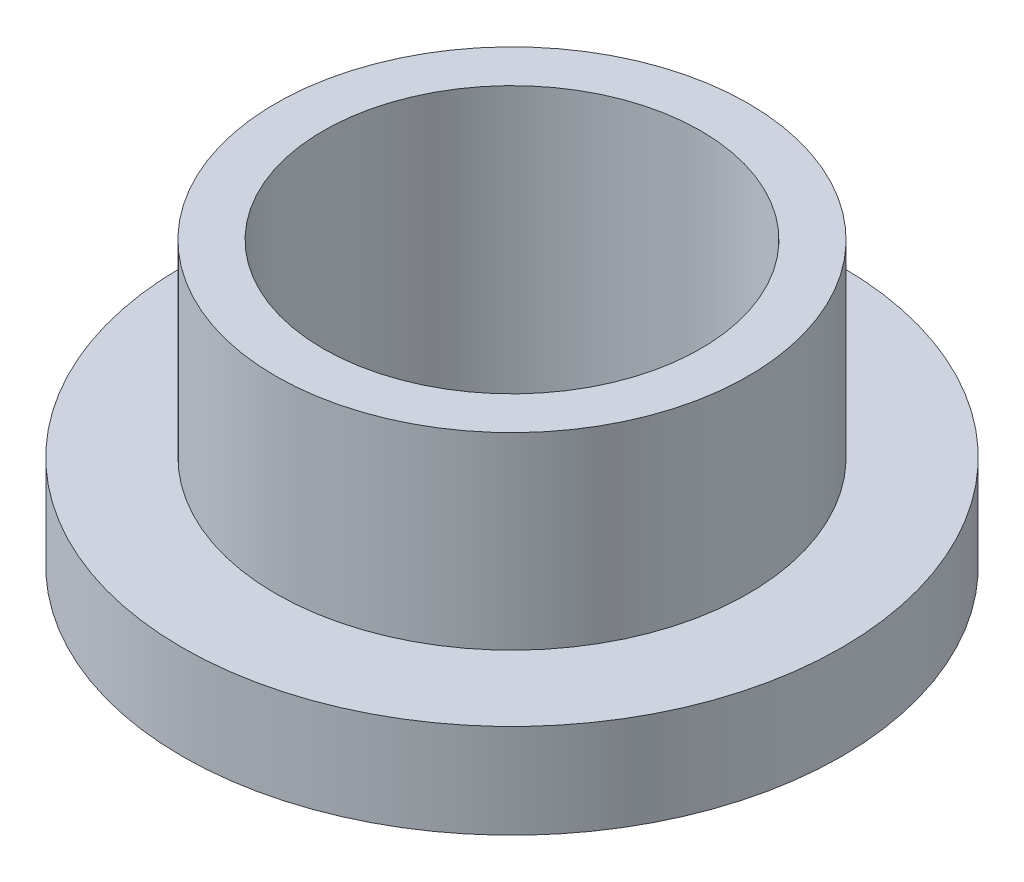
ISO-10303-21;
HEADER;
FILE_DESCRIPTION(('STEP AP214'),'2;1');
FILE_NAME('part.step','',(''),(''),'','','');
FILE_SCHEMA(('AUTOMOTIVE_DESIGN { 1 0 10303 214 1 1 1 1 }'));
ENDSEC;
DATA;
#1=APPLICATION_CONTEXT('core data for automotive mechanical design processes');
#2=APPLICATION_PROTOCOL_DEFINITION('international standard','automotive_design',2000,#1);
#3=PRODUCT_CONTEXT('',#1,'mechanical');
#4=PRODUCT('Part','Part','',(#3));
#5=PRODUCT_RELATED_PRODUCT_CATEGORY('part','',(#4));
#6=PRODUCT_DEFINITION_FORMATION('','',#4);
#7=PRODUCT_DEFINITION_CONTEXT('part definition',#1,'design');
#8=PRODUCT_DEFINITION('design','',#6,#7);
#9=PRODUCT_DEFINITION_SHAPE('','',#8);
#10=(LENGTH_UNIT() NAMED_UNIT(*) SI_UNIT(.MILLI.,.METRE.));
#11=(NAMED_UNIT(*) PLANE_ANGLE_UNIT() SI_UNIT($,.RADIAN.));
#12=(NAMED_UNIT(*) SI_UNIT($,.STERADIAN.) SOLID_ANGLE_UNIT());
#13=UNCERTAINTY_MEASURE_WITH_UNIT(LENGTH_MEASURE(1.E-05),#10,'distance_accuracy_value','');
#14=(GEOMETRIC_REPRESENTATION_CONTEXT(3) GLOBAL_UNCERTAINTY_ASSIGNED_CONTEXT((#13)) GLOBAL_UNIT_ASSIGNED_CONTEXT((#10,
#11,#12)) REPRESENTATION_CONTEXT('',''));
#15=CARTESIAN_POINT('',(0.,0.,0.));
#16=DIRECTION('',(0.,0.,1.));
#17=DIRECTION('',(1.,0.,0.));
#18=AXIS2_PLACEMENT_3D('',#15,#16,#17);
#19=CARTESIAN_POINT('',(0.,9.525,0.));
#20=DIRECTION('',(0.,1.,0.));
#21=DIRECTION('',(0.,0.,1.));
#22=AXIS2_PLACEMENT_3D('',#19,#20,#21);
#23=PLANE('',#22);
#24=CARTESIAN_POINT('',(0.,9.525,0.));
#25=DIRECTION('',(0.,1.,0.));
#26=DIRECTION('',(0.,0.,1.));
#27=AXIS2_PLACEMENT_3D('',#24,#25,#26);
#28=CIRCLE('',#27,7.9629);
#29=CARTESIAN_POINT('',(0.,9.525,7.9629));
#30=VERTEX_POINT('',#29);
#31=EDGE_CURVE('E10',#30,#30,#28,.T.);
#32=ORIENTED_EDGE('',*,*,#31,.T.);
#33=EDGE_LOOP('',(#32));
#34=FACE_BOUND('',#33,.T.);
#35=CARTESIAN_POINT('',(0.,9.525,0.));
#36=DIRECTION('',(0.,1.,0.));
#37=DIRECTION('',(0.,0.,1.));
#38=AXIS2_PLACEMENT_3D('',#35,#36,#37);
#39=CIRCLE('',#38,6.3627);
#40=CARTESIAN_POINT('',(0.,9.525,6.3627));
#41=VERTEX_POINT('',#40);
#42=EDGE_CURVE('E37',#41,#41,#39,.T.);
#43=ORIENTED_EDGE('',*,*,#42,.F.);
#44=EDGE_LOOP('',(#43));
#45=FACE_BOUND('',#44,.T.);
#46=ADVANCED_FACE('F30',(#34,#45),#23,.T.);
#47=CARTESIAN_POINT('',(0.,0.,0.));
#48=DIRECTION('',(0.,1.,0.));
#49=DIRECTION('',(0.,0.,1.));
#50=AXIS2_PLACEMENT_3D('',#47,#48,#49);
#51=PLANE('',#50);
#52=CARTESIAN_POINT('',(0.,0.,0.));
#53=DIRECTION('',(0.,1.,0.));
#54=DIRECTION('',(0.,0.,1.));
#55=AXIS2_PLACEMENT_3D('',#52,#53,#54);
#56=CIRCLE('',#55,6.3627);
#57=CARTESIAN_POINT('',(0.,0.,6.3627));
#58=VERTEX_POINT('',#57);
#59=EDGE_CURVE('E41',#58,#58,#56,.T.);
#60=ORIENTED_EDGE('',*,*,#59,.T.);
#61=EDGE_LOOP('',(#60));
#62=FACE_BOUND('',#61,.T.);
#63=CARTESIAN_POINT('',(0.,0.,0.));
#64=DIRECTION('',(0.,1.,0.));
#65=DIRECTION('',(0.,0.,1.));
#66=AXIS2_PLACEMENT_3D('',#63,#64,#65);
#67=CIRCLE('',#66,11.1125);
#68=CARTESIAN_POINT('',(0.,0.,11.1125));
#69=VERTEX_POINT('',#68);
#70=EDGE_CURVE('E48',#69,#69,#67,.T.);
#71=ORIENTED_EDGE('',*,*,#70,.F.);
#72=EDGE_LOOP('',(#71));
#73=FACE_BOUND('',#72,.T.);
#74=ADVANCED_FACE('F73',(#62,#73),#51,.F.);
#75=CARTESIAN_POINT('',(0.,9.525,0.));
#76=DIRECTION('',(0.,-1.,0.));
#77=DIRECTION('',(0.,0.,-1.));
#78=AXIS2_PLACEMENT_3D('',#75,#76,#77);
#79=CYLINDRICAL_SURFACE('',#78,7.9629);
#80=CARTESIAN_POINT('',(0.,3.175,0.));
#81=DIRECTION('',(0.,1.,0.));
#82=DIRECTION('',(0.,0.,1.));
#83=AXIS2_PLACEMENT_3D('',#80,#81,#82);
#84=CIRCLE('',#83,7.9629);
#85=CARTESIAN_POINT('',(0.,3.175,7.9629));
#86=VERTEX_POINT('',#85);
#87=EDGE_CURVE('E51',#86,#86,#84,.T.);
#88=ORIENTED_EDGE('',*,*,#87,.T.);
#89=EDGE_LOOP('',(#88));
#90=FACE_BOUND('',#89,.T.);
#91=ORIENTED_EDGE('',*,*,#31,.F.);
#92=EDGE_LOOP('',(#91));
#93=FACE_BOUND('',#92,.T.);
#94=ADVANCED_FACE('F32',(#90,#93),#79,.T.);
#95=CARTESIAN_POINT('',(0.,9.525,0.));
#96=DIRECTION('',(0.,-1.,0.));
#97=DIRECTION('',(0.,0.,-1.));
#98=AXIS2_PLACEMENT_3D('',#95,#96,#97);
#99=CYLINDRICAL_SURFACE('',#98,6.3627);
#100=ORIENTED_EDGE('',*,*,#42,.T.);
#101=EDGE_LOOP('',(#100));
#102=FACE_BOUND('',#101,.T.);
#103=ORIENTED_EDGE('',*,*,#59,.F.);
#104=EDGE_LOOP('',(#103));
#105=FACE_BOUND('',#104,.T.);
#106=ADVANCED_FACE('F62',(#102,#105),#99,.F.);
#107=CARTESIAN_POINT('',(0.,3.175,0.));
#108=DIRECTION('',(0.,1.,0.));
#109=DIRECTION('',(0.,0.,1.));
#110=AXIS2_PLACEMENT_3D('',#107,#108,#109);
#111=PLANE('',#110);
#112=CARTESIAN_POINT('',(0.,3.175,0.));
#113=DIRECTION('',(0.,1.,0.));
#114=DIRECTION('',(0.,0.,1.));
#115=AXIS2_PLACEMENT_3D('',#112,#113,#114);
#116=CIRCLE('',#115,11.1125);
#117=CARTESIAN_POINT('',(0.,3.175,11.1125));
#118=VERTEX_POINT('',#117);
#119=EDGE_CURVE('E46',#118,#118,#116,.T.);
#120=ORIENTED_EDGE('',*,*,#119,.T.);
#121=EDGE_LOOP('',(#120));
#122=FACE_BOUND('',#121,.T.);
#123=ORIENTED_EDGE('',*,*,#87,.F.);
#124=EDGE_LOOP('',(#123));
#125=FACE_BOUND('',#124,.T.);
#126=ADVANCED_FACE('F59',(#122,#125),#111,.T.);
#127=CARTESIAN_POINT('',(0.,3.175,0.));
#128=DIRECTION('',(0.,-1.,0.));
#129=DIRECTION('',(0.,0.,-1.));
#130=AXIS2_PLACEMENT_3D('',#127,#128,#129);
#131=CYLINDRICAL_SURFACE('',#130,11.1125);
#132=ORIENTED_EDGE('',*,*,#119,.F.);
#133=EDGE_LOOP('',(#132));
#134=FACE_BOUND('',#133,.T.);
#135=ORIENTED_EDGE('',*,*,#70,.T.);
#136=EDGE_LOOP('',(#135));
#137=FACE_BOUND('',#136,.T.);
#138=ADVANCED_FACE('F61',(#134,#137),#131,.T.);
#139=CLOSED_SHELL('',(#46,#74,#94,#106,#126,#138));
#140=MANIFOLD_SOLID_BREP('B2',#139);
#141=ADVANCED_BREP_SHAPE_REPRESENTATION('',(#18,#140),#14);
#142=SHAPE_DEFINITION_REPRESENTATION(#9,#141);
ENDSEC;
END-ISO-10303-21;
